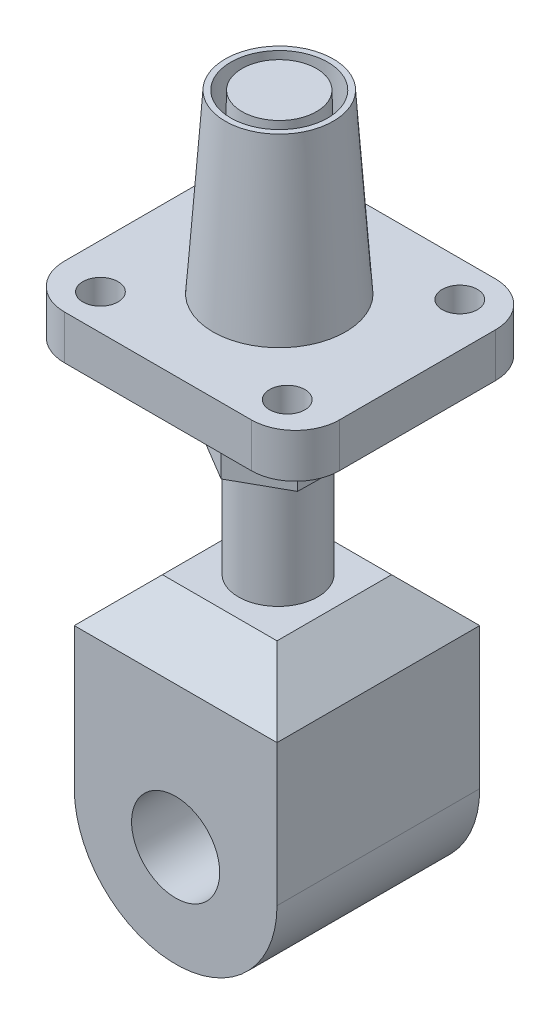
ISO-10303-21;
HEADER;
FILE_DESCRIPTION(('STEP AP214'),'2;1');
FILE_NAME('part.step','',(''),(''),'','','');
FILE_SCHEMA(('AUTOMOTIVE_DESIGN { 1 0 10303 214 1 1 1 1 }'));
ENDSEC;
DATA;
#1=APPLICATION_CONTEXT('core data for automotive mechanical design processes');
#2=APPLICATION_PROTOCOL_DEFINITION('international standard','automotive_design',2000,#1);
#3=PRODUCT_CONTEXT('',#1,'mechanical');
#4=PRODUCT('Part','Part','',(#3));
#5=PRODUCT_RELATED_PRODUCT_CATEGORY('part','',(#4));
#6=PRODUCT_DEFINITION_FORMATION('','',#4);
#7=PRODUCT_DEFINITION_CONTEXT('part definition',#1,'design');
#8=PRODUCT_DEFINITION('design','',#6,#7);
#9=PRODUCT_DEFINITION_SHAPE('','',#8);
#10=(LENGTH_UNIT() NAMED_UNIT(*) SI_UNIT(.MILLI.,.METRE.));
#11=(NAMED_UNIT(*) PLANE_ANGLE_UNIT() SI_UNIT($,.RADIAN.));
#12=(NAMED_UNIT(*) SI_UNIT($,.STERADIAN.) SOLID_ANGLE_UNIT());
#13=UNCERTAINTY_MEASURE_WITH_UNIT(LENGTH_MEASURE(1.E-05),#10,'distance_accuracy_value','');
#14=(GEOMETRIC_REPRESENTATION_CONTEXT(3) GLOBAL_UNCERTAINTY_ASSIGNED_CONTEXT((#13)) GLOBAL_UNIT_ASSIGNED_CONTEXT((#10,
#11,#12)) REPRESENTATION_CONTEXT('',''));
#15=CARTESIAN_POINT('',(0.,0.,0.));
#16=DIRECTION('',(0.,0.,1.));
#17=DIRECTION('',(1.,0.,0.));
#18=AXIS2_PLACEMENT_3D('',#15,#16,#17);
#19=CARTESIAN_POINT('',(0.,87.0242178064716,22.4844557505435));
#20=DIRECTION('',(0.,-1.,0.));
#21=DIRECTION('',(0.,0.,-1.));
#22=AXIS2_PLACEMENT_3D('',#19,#20,#21);
#23=CYLINDRICAL_SURFACE('',#22,9.52563837691278);
#24=CARTESIAN_POINT('',(0.,77.0242178064716,22.4844557505435));
#25=DIRECTION('',(0.,1.,0.));
#26=DIRECTION('',(0.,0.,1.));
#27=AXIS2_PLACEMENT_3D('',#24,#25,#26);
#28=CIRCLE('',#27,9.52563837691278);
#29=CARTESIAN_POINT('',(0.,77.0242178064716,32.0100941274563));
#30=VERTEX_POINT('',#29);
#31=EDGE_CURVE('E342',#30,#30,#28,.T.);
#32=ORIENTED_EDGE('',*,*,#31,.T.);
#33=EDGE_LOOP('',(#32));
#34=FACE_BOUND('',#33,.T.);
#35=CARTESIAN_POINT('',(0.,87.0242178064716,22.4844557505435));
#36=DIRECTION('',(0.,1.,0.));
#37=DIRECTION('',(0.,0.,1.));
#38=AXIS2_PLACEMENT_3D('',#35,#36,#37);
#39=CIRCLE('',#38,9.52563837691278);
#40=CARTESIAN_POINT('',(0.,87.0242178064716,32.0100941274563));
#41=VERTEX_POINT('',#40);
#42=EDGE_CURVE('E260',#41,#41,#39,.T.);
#43=ORIENTED_EDGE('',*,*,#42,.F.);
#44=EDGE_LOOP('',(#43));
#45=FACE_BOUND('',#44,.T.);
#46=ADVANCED_FACE('F41',(#34,#45),#23,.T.);
#47=CARTESIAN_POINT('',(-23.,0.,46.));
#48=DIRECTION('',(-1.,0.,0.));
#49=DIRECTION('',(0.,0.,1.));
#50=AXIS2_PLACEMENT_3D('',#47,#48,#49);
#51=PLANE('',#50);
#52=DIRECTION('',(0.,1.,0.));
#53=VECTOR('',#52,1.);
#54=CARTESIAN_POINT('',(-23.,0.,46.));
#55=LINE('',#54,#53);
#56=CARTESIAN_POINT('',(-23.,0.,46.));
#57=VERTEX_POINT('',#56);
#58=CARTESIAN_POINT('',(-23.,32.0484356129433,46.));
#59=VERTEX_POINT('',#58);
#60=EDGE_CURVE('E217',#57,#59,#55,.T.);
#61=ORIENTED_EDGE('',*,*,#60,.T.);
#62=DIRECTION('',(0.,0.,-1.));
#63=VECTOR('',#62,1.);
#64=CARTESIAN_POINT('',(-23.,32.0484356129433,46.));
#65=LINE('',#64,#63);
#66=CARTESIAN_POINT('',(-23.,32.0484356129433,0.));
#67=VERTEX_POINT('',#66);
#68=EDGE_CURVE('E242',#59,#67,#65,.T.);
#69=ORIENTED_EDGE('',*,*,#68,.T.);
#70=DIRECTION('',(0.,1.,0.));
#71=VECTOR('',#70,1.);
#72=CARTESIAN_POINT('',(-23.,0.,0.));
#73=LINE('',#72,#71);
#74=CARTESIAN_POINT('',(-23.,0.,0.));
#75=VERTEX_POINT('',#74);
#76=EDGE_CURVE('E230',#75,#67,#73,.T.);
#77=ORIENTED_EDGE('',*,*,#76,.F.);
#78=DIRECTION('',(0.,0.,-1.));
#79=VECTOR('',#78,1.);
#80=CARTESIAN_POINT('',(-23.,0.,46.));
#81=LINE('',#80,#79);
#82=EDGE_CURVE('E240',#57,#75,#81,.T.);
#83=ORIENTED_EDGE('',*,*,#82,.F.);
#84=EDGE_LOOP('',(#61,#69,#77,#83));
#85=FACE_BOUND('',#84,.T.);
#86=ADVANCED_FACE('F397',(#85),#51,.T.);
#87=CARTESIAN_POINT('',(0.,0.,46.));
#88=DIRECTION('',(0.,0.,-1.));
#89=DIRECTION('',(-1.,0.,0.));
#90=AXIS2_PLACEMENT_3D('',#87,#88,#89);
#91=CYLINDRICAL_SURFACE('',#90,23.);
#92=CARTESIAN_POINT('',(0.,0.,0.));
#93=DIRECTION('',(0.,0.,1.));
#94=DIRECTION('',(1.,0.,0.));
#95=AXIS2_PLACEMENT_3D('',#92,#93,#94);
#96=CIRCLE('',#95,23.);
#97=CARTESIAN_POINT('',(23.,0.,0.));
#98=VERTEX_POINT('',#97);
#99=EDGE_CURVE('E234',#75,#98,#96,.T.);
#100=ORIENTED_EDGE('',*,*,#99,.T.);
#101=DIRECTION('',(0.,0.,-1.));
#102=VECTOR('',#101,1.);
#103=CARTESIAN_POINT('',(23.,0.,46.));
#104=LINE('',#103,#102);
#105=CARTESIAN_POINT('',(23.,0.,46.));
#106=VERTEX_POINT('',#105);
#107=EDGE_CURVE('E226',#106,#98,#104,.T.);
#108=ORIENTED_EDGE('',*,*,#107,.F.);
#109=CARTESIAN_POINT('',(0.,0.,46.));
#110=DIRECTION('',(0.,0.,1.));
#111=DIRECTION('',(1.,0.,0.));
#112=AXIS2_PLACEMENT_3D('',#109,#110,#111);
#113=CIRCLE('',#112,23.);
#114=EDGE_CURVE('E221',#57,#106,#113,.T.);
#115=ORIENTED_EDGE('',*,*,#114,.F.);
#116=ORIENTED_EDGE('',*,*,#82,.T.);
#117=EDGE_LOOP('',(#100,#108,#115,#116));
#118=FACE_BOUND('',#117,.T.);
#119=ADVANCED_FACE('F403',(#118),#91,.T.);
#120=CARTESIAN_POINT('',(23.,0.,46.));
#121=DIRECTION('',(1.,0.,0.));
#122=DIRECTION('',(0.,0.,-1.));
#123=AXIS2_PLACEMENT_3D('',#120,#121,#122);
#124=PLANE('',#123);
#125=DIRECTION('',(0.,-1.,0.));
#126=VECTOR('',#125,1.);
#127=CARTESIAN_POINT('',(23.,0.,0.));
#128=LINE('',#127,#126);
#129=CARTESIAN_POINT('',(23.,32.0484356129433,0.));
#130=VERTEX_POINT('',#129);
#131=EDGE_CURVE('E218',#130,#98,#128,.T.);
#132=ORIENTED_EDGE('',*,*,#131,.F.);
#133=DIRECTION('',(0.,0.,1.));
#134=VECTOR('',#133,1.);
#135=CARTESIAN_POINT('',(23.,32.0484356129433,46.));
#136=LINE('',#135,#134);
#137=CARTESIAN_POINT('',(23.,32.0484356129433,46.));
#138=VERTEX_POINT('',#137);
#139=EDGE_CURVE('E256',#130,#138,#136,.T.);
#140=ORIENTED_EDGE('',*,*,#139,.T.);
#141=DIRECTION('',(0.,-1.,0.));
#142=VECTOR('',#141,1.);
#143=CARTESIAN_POINT('',(23.,0.,46.));
#144=LINE('',#143,#142);
#145=EDGE_CURVE('E224',#138,#106,#144,.T.);
#146=ORIENTED_EDGE('',*,*,#145,.T.);
#147=ORIENTED_EDGE('',*,*,#107,.T.);
#148=EDGE_LOOP('',(#132,#140,#146,#147));
#149=FACE_BOUND('',#148,.T.);
#150=ADVANCED_FACE('F730',(#149),#124,.T.);
#151=CARTESIAN_POINT('',(0.,0.,46.));
#152=DIRECTION('',(0.,0.,-1.));
#153=DIRECTION('',(-1.,0.,0.));
#154=AXIS2_PLACEMENT_3D('',#151,#152,#153);
#155=CYLINDRICAL_SURFACE('',#154,10.);
#156=CARTESIAN_POINT('',(0.,0.,46.));
#157=DIRECTION('',(0.,0.,1.));
#158=DIRECTION('',(1.,0.,0.));
#159=AXIS2_PLACEMENT_3D('',#156,#157,#158);
#160=CIRCLE('',#159,10.);
#161=CARTESIAN_POINT('',(10.,0.,46.));
#162=VERTEX_POINT('',#161);
#163=EDGE_CURVE('E214',#162,#162,#160,.T.);
#164=ORIENTED_EDGE('',*,*,#163,.T.);
#165=EDGE_LOOP('',(#164));
#166=FACE_BOUND('',#165,.T.);
#167=CARTESIAN_POINT('',(0.,0.,0.));
#168=DIRECTION('',(0.,0.,1.));
#169=DIRECTION('',(1.,0.,0.));
#170=AXIS2_PLACEMENT_3D('',#167,#168,#169);
#171=CIRCLE('',#170,10.);
#172=CARTESIAN_POINT('',(10.,0.,0.));
#173=VERTEX_POINT('',#172);
#174=EDGE_CURVE('E227',#173,#173,#171,.T.);
#175=ORIENTED_EDGE('',*,*,#174,.F.);
#176=EDGE_LOOP('',(#175));
#177=FACE_BOUND('',#176,.T.);
#178=ADVANCED_FACE('F735',(#166,#177),#155,.F.);
#179=CARTESIAN_POINT('',(0.,42.0484356129433,46.));
#180=DIRECTION('',(0.,1.,0.));
#181=DIRECTION('',(0.,0.,1.));
#182=AXIS2_PLACEMENT_3D('',#179,#180,#181);
#183=PLANE('',#182);
#184=CARTESIAN_POINT('',(0.,42.0484356129433,22.7569924059425));
#185=DIRECTION('',(0.,1.,0.));
#186=DIRECTION('',(0.,0.,1.));
#187=AXIS2_PLACEMENT_3D('',#184,#185,#186);
#188=CIRCLE('',#187,9.);
#189=CARTESIAN_POINT('',(0.,42.0484356129433,31.7569924059425));
#190=VERTEX_POINT('',#189);
#191=EDGE_CURVE('E208',#190,#190,#188,.F.);
#192=ORIENTED_EDGE('',*,*,#191,.T.);
#193=EDGE_LOOP('',(#192));
#194=FACE_BOUND('',#193,.T.);
#195=DIRECTION('',(-1.,0.,0.));
#196=VECTOR('',#195,1.);
#197=CARTESIAN_POINT('',(-23.,42.0484356129433,9.99999999999999));
#198=LINE('',#197,#196);
#199=CARTESIAN_POINT('',(13.,42.0484356129433,9.99999999999999));
#200=VERTEX_POINT('',#199);
#201=CARTESIAN_POINT('',(-13.,42.0484356129433,9.99999999999999));
#202=VERTEX_POINT('',#201);
#203=EDGE_CURVE('E249',#200,#202,#198,.T.);
#204=ORIENTED_EDGE('',*,*,#203,.T.);
#205=DIRECTION('',(0.,0.,1.));
#206=VECTOR('',#205,1.);
#207=CARTESIAN_POINT('',(-13.,42.0484356129433,46.));
#208=LINE('',#207,#206);
#209=CARTESIAN_POINT('',(-13.,42.0484356129433,36.));
#210=VERTEX_POINT('',#209);
#211=EDGE_CURVE('E251',#202,#210,#208,.T.);
#212=ORIENTED_EDGE('',*,*,#211,.T.);
#213=DIRECTION('',(1.,0.,0.));
#214=VECTOR('',#213,1.);
#215=CARTESIAN_POINT('',(0.,42.0484356129433,36.));
#216=LINE('',#215,#214);
#217=CARTESIAN_POINT('',(13.,42.0484356129433,36.));
#218=VERTEX_POINT('',#217);
#219=EDGE_CURVE('E245',#210,#218,#216,.T.);
#220=ORIENTED_EDGE('',*,*,#219,.T.);
#221=DIRECTION('',(0.,0.,-1.));
#222=VECTOR('',#221,1.);
#223=CARTESIAN_POINT('',(13.,42.0484356129433,46.));
#224=LINE('',#223,#222);
#225=EDGE_CURVE('E247',#218,#200,#224,.T.);
#226=ORIENTED_EDGE('',*,*,#225,.T.);
#227=EDGE_LOOP('',(#204,#212,#220,#226));
#228=FACE_BOUND('',#227,.T.);
#229=ADVANCED_FACE('F722',(#194,#228),#183,.T.);
#230=CARTESIAN_POINT('',(0.,0.,46.));
#231=DIRECTION('',(0.,0.,1.));
#232=DIRECTION('',(1.,0.,0.));
#233=AXIS2_PLACEMENT_3D('',#230,#231,#232);
#234=PLANE('',#233);
#235=ORIENTED_EDGE('',*,*,#163,.F.);
#236=EDGE_LOOP('',(#235));
#237=FACE_BOUND('',#236,.T.);
#238=ORIENTED_EDGE('',*,*,#145,.F.);
#239=DIRECTION('',(-1.,0.,0.));
#240=VECTOR('',#239,1.);
#241=CARTESIAN_POINT('',(0.,32.0484356129433,46.));
#242=LINE('',#241,#240);
#243=EDGE_CURVE('E258',#138,#59,#242,.T.);
#244=ORIENTED_EDGE('',*,*,#243,.T.);
#245=ORIENTED_EDGE('',*,*,#60,.F.);
#246=ORIENTED_EDGE('',*,*,#114,.T.);
#247=EDGE_LOOP('',(#238,#244,#245,#246));
#248=FACE_BOUND('',#247,.T.);
#249=ADVANCED_FACE('F710',(#237,#248),#234,.T.);
#250=CARTESIAN_POINT('',(0.,0.,0.));
#251=DIRECTION('',(0.,0.,1.));
#252=DIRECTION('',(1.,0.,0.));
#253=AXIS2_PLACEMENT_3D('',#250,#251,#252);
#254=PLANE('',#253);
#255=ORIENTED_EDGE('',*,*,#174,.T.);
#256=EDGE_LOOP('',(#255));
#257=FACE_BOUND('',#256,.T.);
#258=ORIENTED_EDGE('',*,*,#76,.T.);
#259=DIRECTION('',(1.,0.,0.));
#260=VECTOR('',#259,1.);
#261=CARTESIAN_POINT('',(23.,32.0484356129433,0.));
#262=LINE('',#261,#260);
#263=EDGE_CURVE('E254',#67,#130,#262,.T.);
#264=ORIENTED_EDGE('',*,*,#263,.T.);
#265=ORIENTED_EDGE('',*,*,#131,.T.);
#266=ORIENTED_EDGE('',*,*,#99,.F.);
#267=EDGE_LOOP('',(#258,#264,#265,#266));
#268=FACE_BOUND('',#267,.T.);
#269=ADVANCED_FACE('F701',(#257,#268),#254,.F.);
#270=CARTESIAN_POINT('',(13.,42.0484356129433,46.));
#271=DIRECTION('',(-0.707106781186548,-0.707106781186546,0.));
#272=DIRECTION('',(0.,0.,-1.));
#273=AXIS2_PLACEMENT_3D('',#270,#271,#272);
#274=PLANE('',#273);
#275=DIRECTION('',(0.577350269189625,-0.577350269189627,-0.577350269189625));
#276=VECTOR('',#275,1.);
#277=CARTESIAN_POINT('',(1.00000000000003,54.0484356129433,22.));
#278=LINE('',#277,#276);
#279=EDGE_CURVE('E265',#200,#130,#278,.T.);
#280=ORIENTED_EDGE('',*,*,#279,.F.);
#281=ORIENTED_EDGE('',*,*,#225,.F.);
#282=DIRECTION('',(-0.577350269189625,0.577350269189627,-0.577350269189625));
#283=VECTOR('',#282,1.);
#284=CARTESIAN_POINT('',(8.66666666666668,46.3817689462766,31.6666666666667));
#285=LINE('',#284,#283);
#286=EDGE_CURVE('E231',#138,#218,#285,.T.);
#287=ORIENTED_EDGE('',*,*,#286,.F.);
#288=ORIENTED_EDGE('',*,*,#139,.F.);
#289=EDGE_LOOP('',(#280,#281,#287,#288));
#290=FACE_BOUND('',#289,.T.);
#291=ADVANCED_FACE('F692',(#290),#274,.F.);
#292=CARTESIAN_POINT('',(0.,42.0484356129433,36.));
#293=DIRECTION('',(0.,-0.707106781186546,-0.707106781186548));
#294=DIRECTION('',(1.,0.,0.));
#295=AXIS2_PLACEMENT_3D('',#292,#293,#294);
#296=PLANE('',#295);
#297=ORIENTED_EDGE('',*,*,#286,.T.);
#298=ORIENTED_EDGE('',*,*,#219,.F.);
#299=DIRECTION('',(-0.577350269189625,-0.577350269189627,0.577350269189625));
#300=VECTOR('',#299,1.);
#301=CARTESIAN_POINT('',(-8.66666666666668,46.3817689462766,31.6666666666667));
#302=LINE('',#301,#300);
#303=EDGE_CURVE('E263',#59,#210,#302,.F.);
#304=ORIENTED_EDGE('',*,*,#303,.F.);
#305=ORIENTED_EDGE('',*,*,#243,.F.);
#306=EDGE_LOOP('',(#297,#298,#304,#305));
#307=FACE_BOUND('',#306,.T.);
#308=ADVANCED_FACE('F683',(#307),#296,.F.);
#309=CARTESIAN_POINT('',(0.,32.0484356129433,0.));
#310=DIRECTION('',(0.,0.707106781186546,-0.707106781186548));
#311=DIRECTION('',(-1.,0.,0.));
#312=AXIS2_PLACEMENT_3D('',#309,#310,#311);
#313=PLANE('',#312);
#314=ORIENTED_EDGE('',*,*,#279,.T.);
#315=ORIENTED_EDGE('',*,*,#263,.F.);
#316=DIRECTION('',(-0.577350269189625,-0.577350269189627,-0.577350269189625));
#317=VECTOR('',#316,1.);
#318=CARTESIAN_POINT('',(-15.3333333333333,39.7151022796099,7.66666666666665));
#319=LINE('',#318,#317);
#320=EDGE_CURVE('E261',#202,#67,#319,.T.);
#321=ORIENTED_EDGE('',*,*,#320,.F.);
#322=ORIENTED_EDGE('',*,*,#203,.F.);
#323=EDGE_LOOP('',(#314,#315,#321,#322));
#324=FACE_BOUND('',#323,.T.);
#325=ADVANCED_FACE('F674',(#324),#313,.T.);
#326=CARTESIAN_POINT('',(-23.,32.0484356129433,46.));
#327=DIRECTION('',(0.707106781186548,-0.707106781186546,0.));
#328=DIRECTION('',(0.,0.,-1.));
#329=AXIS2_PLACEMENT_3D('',#326,#327,#328);
#330=PLANE('',#329);
#331=ORIENTED_EDGE('',*,*,#303,.T.);
#332=ORIENTED_EDGE('',*,*,#211,.F.);
#333=ORIENTED_EDGE('',*,*,#320,.T.);
#334=ORIENTED_EDGE('',*,*,#68,.F.);
#335=EDGE_LOOP('',(#331,#332,#333,#334));
#336=FACE_BOUND('',#335,.T.);
#337=ADVANCED_FACE('F664',(#336),#330,.F.);
#338=CARTESIAN_POINT('',(0.,67.0242178064716,22.7569924059425));
#339=DIRECTION('',(0.,-1.,0.));
#340=DIRECTION('',(0.,0.,-1.));
#341=AXIS2_PLACEMENT_3D('',#338,#339,#340);
#342=CYLINDRICAL_SURFACE('',#341,9.);
#343=ORIENTED_EDGE('',*,*,#191,.F.);
#344=EDGE_LOOP('',(#343));
#345=FACE_BOUND('',#344,.T.);
#346=CARTESIAN_POINT('',(0.,67.0242178064716,22.7569924059425));
#347=DIRECTION('',(0.,1.,0.));
#348=DIRECTION('',(0.,0.,1.));
#349=AXIS2_PLACEMENT_3D('',#346,#347,#348);
#350=CIRCLE('',#349,9.);
#351=CARTESIAN_POINT('',(0.,67.0242178064716,31.7569924059425));
#352=VERTEX_POINT('',#351);
#353=EDGE_CURVE('E205',#352,#352,#350,.T.);
#354=ORIENTED_EDGE('',*,*,#353,.F.);
#355=EDGE_LOOP('',(#354));
#356=FACE_BOUND('',#355,.T.);
#357=ADVANCED_FACE('F656',(#345,#356),#342,.T.);
#358=CARTESIAN_POINT('',(-0.179771257897109,77.0242178064716,35.4975389919702));
#359=DIRECTION('',(-0.487731685204601,0.,-0.872993587174316));
#360=DIRECTION('',(-0.872993587174316,0.,0.487731685204601));
#361=AXIS2_PLACEMENT_3D('',#358,#359,#360);
#362=PLANE('',#361);
#363=DIRECTION('',(0.872993587174316,0.,-0.487731685204601));
#364=VECTOR('',#363,1.);
#365=CARTESIAN_POINT('',(-0.179771257897109,67.0242178064716,35.4975389919702));
#366=LINE('',#365,#364);
#367=CARTESIAN_POINT('',(-0.179771257897109,67.0242178064716,35.4975389919702));
#368=VERTEX_POINT('',#367);
#369=CARTESIAN_POINT('',(10.9437513726505,67.0242178064716,29.2829521751655));
#370=VERTEX_POINT('',#369);
#371=EDGE_CURVE('E204',#368,#370,#366,.T.);
#372=ORIENTED_EDGE('',*,*,#371,.T.);
#373=DIRECTION('',(0.,-1.,0.));
#374=VECTOR('',#373,1.);
#375=CARTESIAN_POINT('',(10.9437513726505,77.0242178064716,29.2829521751655));
#376=LINE('',#375,#374);
#377=CARTESIAN_POINT('',(10.9437513726505,77.0242178064716,29.2829521751655));
#378=VERTEX_POINT('',#377);
#379=EDGE_CURVE('E184',#378,#370,#376,.T.);
#380=ORIENTED_EDGE('',*,*,#379,.F.);
#381=DIRECTION('',(0.872993587174316,0.,-0.487731685204601));
#382=VECTOR('',#381,1.);
#383=CARTESIAN_POINT('',(-0.179771257897109,77.0242178064716,35.4975389919702));
#384=LINE('',#383,#382);
#385=CARTESIAN_POINT('',(-0.179771257897109,77.0242178064716,35.4975389919702));
#386=VERTEX_POINT('',#385);
#387=EDGE_CURVE('E191',#386,#378,#384,.T.);
#388=ORIENTED_EDGE('',*,*,#387,.F.);
#389=DIRECTION('',(0.,-1.,0.));
#390=VECTOR('',#389,1.);
#391=CARTESIAN_POINT('',(-0.179771257897109,77.0242178064716,35.4975389919702));
#392=LINE('',#391,#390);
#393=EDGE_CURVE('E351',#386,#368,#392,.T.);
#394=ORIENTED_EDGE('',*,*,#393,.T.);
#395=EDGE_LOOP('',(#372,#380,#388,#394));
#396=FACE_BOUND('',#395,.T.);
#397=ADVANCED_FACE('F202',(#396),#362,.F.);
#398=CARTESIAN_POINT('',(10.9437513726505,77.0242178064716,29.2829521751655));
#399=DIRECTION('',(-0.999900466436163,0.,-0.0141087639693788));
#400=DIRECTION('',(-0.0141087639693788,0.,0.999900466436163));
#401=AXIS2_PLACEMENT_3D('',#398,#399,#400);
#402=PLANE('',#401);
#403=DIRECTION('',(0.0141087639693788,0.,-0.999900466436163));
#404=VECTOR('',#403,1.);
#405=CARTESIAN_POINT('',(10.9437513726505,67.0242178064716,29.2829521751655));
#406=LINE('',#405,#404);
#407=CARTESIAN_POINT('',(11.1235226305476,67.0242178064716,16.5424055891379));
#408=VERTEX_POINT('',#407);
#409=EDGE_CURVE('E353',#370,#408,#406,.T.);
#410=ORIENTED_EDGE('',*,*,#409,.T.);
#411=DIRECTION('',(0.,-1.,0.));
#412=VECTOR('',#411,1.);
#413=CARTESIAN_POINT('',(11.1235226305476,77.0242178064716,16.5424055891379));
#414=LINE('',#413,#412);
#415=CARTESIAN_POINT('',(11.1235226305476,77.0242178064716,16.5424055891379));
#416=VERTEX_POINT('',#415);
#417=EDGE_CURVE('E187',#416,#408,#414,.T.);
#418=ORIENTED_EDGE('',*,*,#417,.F.);
#419=DIRECTION('',(0.0141087639693788,0.,-0.999900466436163));
#420=VECTOR('',#419,1.);
#421=CARTESIAN_POINT('',(10.9437513726505,77.0242178064716,29.2829521751655));
#422=LINE('',#421,#420);
#423=EDGE_CURVE('E180',#378,#416,#422,.T.);
#424=ORIENTED_EDGE('',*,*,#423,.F.);
#425=ORIENTED_EDGE('',*,*,#379,.T.);
#426=EDGE_LOOP('',(#410,#418,#424,#425));
#427=FACE_BOUND('',#426,.T.);
#428=ADVANCED_FACE('F182',(#427),#402,.F.);
#429=CARTESIAN_POINT('',(11.1235226305476,77.0242178064716,16.5424055891379));
#430=DIRECTION('',(-0.512168781231562,0.,0.858884823204937));
#431=DIRECTION('',(0.858884823204937,0.,0.512168781231562));
#432=AXIS2_PLACEMENT_3D('',#429,#430,#431);
#433=PLANE('',#432);
#434=DIRECTION('',(-0.858884823204937,0.,-0.512168781231562));
#435=VECTOR('',#434,1.);
#436=CARTESIAN_POINT('',(11.1235226305476,67.0242178064716,16.5424055891379));
#437=LINE('',#436,#435);
#438=CARTESIAN_POINT('',(0.179771257897117,67.0242178064716,10.0164458199148));
#439=VERTEX_POINT('',#438);
#440=EDGE_CURVE('E355',#408,#439,#437,.T.);
#441=ORIENTED_EDGE('',*,*,#440,.T.);
#442=DIRECTION('',(0.,-1.,0.));
#443=VECTOR('',#442,1.);
#444=CARTESIAN_POINT('',(0.179771257897117,77.0242178064716,10.0164458199148));
#445=LINE('',#444,#443);
#446=CARTESIAN_POINT('',(0.179771257897117,77.0242178064716,10.0164458199148));
#447=VERTEX_POINT('',#446);
#448=EDGE_CURVE('E210',#447,#439,#445,.T.);
#449=ORIENTED_EDGE('',*,*,#448,.F.);
#450=DIRECTION('',(-0.858884823204937,0.,-0.512168781231562));
#451=VECTOR('',#450,1.);
#452=CARTESIAN_POINT('',(11.1235226305476,77.0242178064716,16.5424055891379));
#453=LINE('',#452,#451);
#454=EDGE_CURVE('E190',#416,#447,#453,.T.);
#455=ORIENTED_EDGE('',*,*,#454,.F.);
#456=ORIENTED_EDGE('',*,*,#417,.T.);
#457=EDGE_LOOP('',(#441,#449,#455,#456));
#458=FACE_BOUND('',#457,.T.);
#459=ADVANCED_FACE('F387',(#458),#433,.F.);
#460=CARTESIAN_POINT('',(0.179771257897117,77.0242178064716,10.0164458199148));
#461=DIRECTION('',(0.487731685204601,0.,0.872993587174316));
#462=DIRECTION('',(0.872993587174316,0.,-0.487731685204601));
#463=AXIS2_PLACEMENT_3D('',#460,#461,#462);
#464=PLANE('',#463);
#465=DIRECTION('',(-0.872993587174316,0.,0.4877316852046));
#466=VECTOR('',#465,1.);
#467=CARTESIAN_POINT('',(0.179771257897117,67.0242178064716,10.0164458199148));
#468=LINE('',#467,#466);
#469=CARTESIAN_POINT('',(-10.9437513726505,67.0242178064716,16.2310326367195));
#470=VERTEX_POINT('',#469);
#471=EDGE_CURVE('E357',#439,#470,#468,.T.);
#472=ORIENTED_EDGE('',*,*,#471,.T.);
#473=DIRECTION('',(0.,-1.,0.));
#474=VECTOR('',#473,1.);
#475=CARTESIAN_POINT('',(-10.9437513726505,77.0242178064716,16.2310326367195));
#476=LINE('',#475,#474);
#477=CARTESIAN_POINT('',(-10.9437513726505,77.0242178064716,16.2310326367195));
#478=VERTEX_POINT('',#477);
#479=EDGE_CURVE('E366',#478,#470,#476,.T.);
#480=ORIENTED_EDGE('',*,*,#479,.F.);
#481=DIRECTION('',(-0.872993587174316,0.,0.4877316852046));
#482=VECTOR('',#481,1.);
#483=CARTESIAN_POINT('',(0.179771257897117,77.0242178064716,10.0164458199148));
#484=LINE('',#483,#482);
#485=EDGE_CURVE('E346',#447,#478,#484,.T.);
#486=ORIENTED_EDGE('',*,*,#485,.F.);
#487=ORIENTED_EDGE('',*,*,#448,.T.);
#488=EDGE_LOOP('',(#472,#480,#486,#487));
#489=FACE_BOUND('',#488,.T.);
#490=ADVANCED_FACE('F373',(#489),#464,.F.);
#491=CARTESIAN_POINT('',(-10.9437513726505,77.0242178064716,16.2310326367195));
#492=DIRECTION('',(0.999900466436163,0.,0.014108763969379));
#493=DIRECTION('',(0.014108763969379,0.,-0.999900466436163));
#494=AXIS2_PLACEMENT_3D('',#491,#492,#493);
#495=PLANE('',#494);
#496=DIRECTION('',(-0.014108763969379,0.,0.999900466436163));
#497=VECTOR('',#496,1.);
#498=CARTESIAN_POINT('',(-10.9437513726505,67.0242178064716,16.2310326367195));
#499=LINE('',#498,#497);
#500=CARTESIAN_POINT('',(-11.1235226305476,67.0242178064716,28.9715792227472));
#501=VERTEX_POINT('',#500);
#502=EDGE_CURVE('E359',#470,#501,#499,.T.);
#503=ORIENTED_EDGE('',*,*,#502,.T.);
#504=DIRECTION('',(0.,-1.,0.));
#505=VECTOR('',#504,1.);
#506=CARTESIAN_POINT('',(-11.1235226305476,77.0242178064716,28.9715792227472));
#507=LINE('',#506,#505);
#508=CARTESIAN_POINT('',(-11.1235226305476,77.0242178064716,28.9715792227472));
#509=VERTEX_POINT('',#508);
#510=EDGE_CURVE('E363',#509,#501,#507,.T.);
#511=ORIENTED_EDGE('',*,*,#510,.F.);
#512=DIRECTION('',(-0.014108763969379,0.,0.999900466436163));
#513=VECTOR('',#512,1.);
#514=CARTESIAN_POINT('',(-10.9437513726505,77.0242178064716,16.2310326367195));
#515=LINE('',#514,#513);
#516=EDGE_CURVE('E348',#478,#509,#515,.T.);
#517=ORIENTED_EDGE('',*,*,#516,.F.);
#518=ORIENTED_EDGE('',*,*,#479,.T.);
#519=EDGE_LOOP('',(#503,#511,#517,#518));
#520=FACE_BOUND('',#519,.T.);
#521=ADVANCED_FACE('F383',(#520),#495,.F.);
#522=CARTESIAN_POINT('',(-11.1235226305476,77.0242178064716,28.9715792227472));
#523=DIRECTION('',(0.512168781231562,0.,-0.858884823204937));
#524=DIRECTION('',(-0.858884823204937,0.,-0.512168781231562));
#525=AXIS2_PLACEMENT_3D('',#522,#523,#524);
#526=PLANE('',#525);
#527=DIRECTION('',(0.858884823204937,0.,0.512168781231562));
#528=VECTOR('',#527,1.);
#529=CARTESIAN_POINT('',(-11.1235226305476,67.0242178064716,28.9715792227472));
#530=LINE('',#529,#528);
#531=EDGE_CURVE('E200',#501,#368,#530,.T.);
#532=ORIENTED_EDGE('',*,*,#531,.T.);
#533=ORIENTED_EDGE('',*,*,#393,.F.);
#534=DIRECTION('',(0.858884823204937,0.,0.512168781231562));
#535=VECTOR('',#534,1.);
#536=CARTESIAN_POINT('',(-11.1235226305476,77.0242178064716,28.9715792227472));
#537=LINE('',#536,#535);
#538=EDGE_CURVE('E196',#509,#386,#537,.T.);
#539=ORIENTED_EDGE('',*,*,#538,.F.);
#540=ORIENTED_EDGE('',*,*,#510,.T.);
#541=EDGE_LOOP('',(#532,#533,#539,#540));
#542=FACE_BOUND('',#541,.T.);
#543=ADVANCED_FACE('F386',(#542),#526,.F.);
#544=CARTESIAN_POINT('',(0.,77.0242178064716,0.));
#545=DIRECTION('',(0.,1.,0.));
#546=DIRECTION('',(0.,0.,1.));
#547=AXIS2_PLACEMENT_3D('',#544,#545,#546);
#548=PLANE('',#547);
#549=ORIENTED_EDGE('',*,*,#31,.F.);
#550=EDGE_LOOP('',(#549));
#551=FACE_BOUND('',#550,.T.);
#552=ORIENTED_EDGE('',*,*,#387,.T.);
#553=ORIENTED_EDGE('',*,*,#423,.T.);
#554=ORIENTED_EDGE('',*,*,#454,.T.);
#555=ORIENTED_EDGE('',*,*,#485,.T.);
#556=ORIENTED_EDGE('',*,*,#516,.T.);
#557=ORIENTED_EDGE('',*,*,#538,.T.);
#558=EDGE_LOOP('',(#552,#553,#554,#555,#556,#557));
#559=FACE_BOUND('',#558,.T.);
#560=ADVANCED_FACE('F194',(#551,#559),#548,.T.);
#561=CARTESIAN_POINT('',(0.,67.0242178064716,0.));
#562=DIRECTION('',(0.,1.,0.));
#563=DIRECTION('',(0.,0.,1.));
#564=AXIS2_PLACEMENT_3D('',#561,#562,#563);
#565=PLANE('',#564);
#566=ORIENTED_EDGE('',*,*,#353,.T.);
#567=EDGE_LOOP('',(#566));
#568=FACE_BOUND('',#567,.T.);
#569=ORIENTED_EDGE('',*,*,#371,.F.);
#570=ORIENTED_EDGE('',*,*,#531,.F.);
#571=ORIENTED_EDGE('',*,*,#502,.F.);
#572=ORIENTED_EDGE('',*,*,#471,.F.);
#573=ORIENTED_EDGE('',*,*,#440,.F.);
#574=ORIENTED_EDGE('',*,*,#409,.F.);
#575=EDGE_LOOP('',(#569,#570,#571,#572,#573,#574));
#576=FACE_BOUND('',#575,.T.);
#577=ADVANCED_FACE('F379',(#568,#576),#565,.F.);
#578=CARTESIAN_POINT('',(-30.7647614076674,87.0242178064716,-4.94587331660175));
#579=DIRECTION('',(1.,0.,0.));
#580=DIRECTION('',(0.,0.,-1.));
#581=AXIS2_PLACEMENT_3D('',#578,#579,#580);
#582=PLANE('',#581);
#583=DIRECTION('',(0.,0.,-1.));
#584=VECTOR('',#583,1.);
#585=CARTESIAN_POINT('',(-30.7647614076674,97.0242178064716,-4.94587331660175));
#586=LINE('',#585,#584);
#587=CARTESIAN_POINT('',(-30.7647614076674,97.0242178064716,40.4598581284864));
#588=VERTEX_POINT('',#587);
#589=CARTESIAN_POINT('',(-30.7647614076674,97.0242178064716,5.05412668339825));
#590=VERTEX_POINT('',#589);
#591=EDGE_CURVE('E329',#588,#590,#586,.T.);
#592=ORIENTED_EDGE('',*,*,#591,.T.);
#593=DIRECTION('',(0.,1.,0.));
#594=VECTOR('',#593,1.);
#595=CARTESIAN_POINT('',(-30.7647614076674,87.0242178064716,5.05412668339825));
#596=LINE('',#595,#594);
#597=CARTESIAN_POINT('',(-30.7647614076674,87.0242178064716,5.05412668339825));
#598=VERTEX_POINT('',#597);
#599=EDGE_CURVE('E50',#590,#598,#596,.F.);
#600=ORIENTED_EDGE('',*,*,#599,.T.);
#601=DIRECTION('',(0.,0.,-1.));
#602=VECTOR('',#601,1.);
#603=CARTESIAN_POINT('',(-30.7647614076674,87.0242178064716,-4.94587331660175));
#604=LINE('',#603,#602);
#605=CARTESIAN_POINT('',(-30.7647614076674,87.0242178064716,40.4598581284864));
#606=VERTEX_POINT('',#605);
#607=EDGE_CURVE('E339',#606,#598,#604,.T.);
#608=ORIENTED_EDGE('',*,*,#607,.F.);
#609=DIRECTION('',(0.,1.,0.));
#610=VECTOR('',#609,1.);
#611=CARTESIAN_POINT('',(-30.7647614076674,87.0242178064716,40.4598581284864));
#612=LINE('',#611,#610);
#613=EDGE_CURVE('E280',#606,#588,#612,.T.);
#614=ORIENTED_EDGE('',*,*,#613,.T.);
#615=EDGE_LOOP('',(#592,#600,#608,#614));
#616=FACE_BOUND('',#615,.T.);
#617=ADVANCED_FACE('F416',(#616),#582,.F.);
#618=CARTESIAN_POINT('',(-30.7647614076674,87.0242178064716,-4.94587331660175));
#619=DIRECTION('',(0.,0.,1.));
#620=DIRECTION('',(1.,0.,0.));
#621=AXIS2_PLACEMENT_3D('',#618,#619,#620);
#622=PLANE('',#621);
#623=DIRECTION('',(1.,0.,0.));
#624=VECTOR('',#623,1.);
#625=CARTESIAN_POINT('',(-30.7647614076674,87.0242178064716,-4.94587331660175));
#626=LINE('',#625,#624);
#627=CARTESIAN_POINT('',(-20.7647614076674,87.0242178064716,-4.94587331660175));
#628=VERTEX_POINT('',#627);
#629=CARTESIAN_POINT('',(21.639588746274,87.0242178064716,-4.94587331660175));
#630=VERTEX_POINT('',#629);
#631=EDGE_CURVE('E843',#628,#630,#626,.T.);
#632=ORIENTED_EDGE('',*,*,#631,.F.);
#633=DIRECTION('',(0.,1.,0.));
#634=VECTOR('',#633,1.);
#635=CARTESIAN_POINT('',(-20.7647614076674,87.0242178064716,-4.94587331660175));
#636=LINE('',#635,#634);
#637=CARTESIAN_POINT('',(-20.7647614076674,97.0242178064716,-4.94587331660175));
#638=VERTEX_POINT('',#637);
#639=EDGE_CURVE('E309',#628,#638,#636,.T.);
#640=ORIENTED_EDGE('',*,*,#639,.T.);
#641=DIRECTION('',(1.,0.,0.));
#642=VECTOR('',#641,1.);
#643=CARTESIAN_POINT('',(-30.7647614076674,97.0242178064716,-4.94587331660175));
#644=LINE('',#643,#642);
#645=CARTESIAN_POINT('',(21.639588746274,97.0242178064716,-4.94587331660175));
#646=VERTEX_POINT('',#645);
#647=EDGE_CURVE('E324',#638,#646,#644,.T.);
#648=ORIENTED_EDGE('',*,*,#647,.T.);
#649=DIRECTION('',(0.,1.,0.));
#650=VECTOR('',#649,1.);
#651=CARTESIAN_POINT('',(21.639588746274,87.0242178064716,-4.94587331660175));
#652=LINE('',#651,#650);
#653=EDGE_CURVE('E306',#646,#630,#652,.F.);
#654=ORIENTED_EDGE('',*,*,#653,.T.);
#655=EDGE_LOOP('',(#632,#640,#648,#654));
#656=FACE_BOUND('',#655,.T.);
#657=ADVANCED_FACE('F444',(#656),#622,.F.);
#658=CARTESIAN_POINT('',(31.639588746274,87.0242178064716,-4.94587331660175));
#659=DIRECTION('',(-1.,0.,0.));
#660=DIRECTION('',(0.,0.,1.));
#661=AXIS2_PLACEMENT_3D('',#658,#659,#660);
#662=PLANE('',#661);
#663=DIRECTION('',(0.,0.,1.));
#664=VECTOR('',#663,1.);
#665=CARTESIAN_POINT('',(31.639588746274,87.0242178064716,-4.94587331660175));
#666=LINE('',#665,#664);
#667=CARTESIAN_POINT('',(31.639588746274,87.0242178064716,5.05412668339825));
#668=VERTEX_POINT('',#667);
#669=CARTESIAN_POINT('',(31.639588746274,87.0242178064716,40.4598581284864));
#670=VERTEX_POINT('',#669);
#671=EDGE_CURVE('E845',#668,#670,#666,.T.);
#672=ORIENTED_EDGE('',*,*,#671,.F.);
#673=DIRECTION('',(0.,1.,0.));
#674=VECTOR('',#673,1.);
#675=CARTESIAN_POINT('',(31.639588746274,87.0242178064716,5.05412668339825));
#676=LINE('',#675,#674);
#677=CARTESIAN_POINT('',(31.639588746274,97.0242178064716,5.05412668339825));
#678=VERTEX_POINT('',#677);
#679=EDGE_CURVE('E303',#668,#678,#676,.T.);
#680=ORIENTED_EDGE('',*,*,#679,.T.);
#681=DIRECTION('',(0.,0.,1.));
#682=VECTOR('',#681,1.);
#683=CARTESIAN_POINT('',(31.639588746274,97.0242178064716,-4.94587331660175));
#684=LINE('',#683,#682);
#685=CARTESIAN_POINT('',(31.639588746274,97.0242178064716,40.4598581284864));
#686=VERTEX_POINT('',#685);
#687=EDGE_CURVE('E328',#678,#686,#684,.T.);
#688=ORIENTED_EDGE('',*,*,#687,.T.);
#689=DIRECTION('',(0.,1.,0.));
#690=VECTOR('',#689,1.);
#691=CARTESIAN_POINT('',(31.639588746274,87.0242178064716,40.4598581284864));
#692=LINE('',#691,#690);
#693=EDGE_CURVE('E301',#686,#670,#692,.F.);
#694=ORIENTED_EDGE('',*,*,#693,.T.);
#695=EDGE_LOOP('',(#672,#680,#688,#694));
#696=FACE_BOUND('',#695,.T.);
#697=ADVANCED_FACE('F451',(#696),#662,.F.);
#698=CARTESIAN_POINT('',(-30.7647614076674,87.0242178064716,50.4598581284864));
#699=DIRECTION('',(0.,0.,-1.));
#700=DIRECTION('',(-1.,0.,0.));
#701=AXIS2_PLACEMENT_3D('',#698,#699,#700);
#702=PLANE('',#701);
#703=DIRECTION('',(-1.,0.,0.));
#704=VECTOR('',#703,1.);
#705=CARTESIAN_POINT('',(-30.7647614076674,97.0242178064716,50.4598581284864));
#706=LINE('',#705,#704);
#707=CARTESIAN_POINT('',(21.639588746274,97.0242178064716,50.4598581284864));
#708=VERTEX_POINT('',#707);
#709=CARTESIAN_POINT('',(-20.7647614076674,97.0242178064716,50.4598581284864));
#710=VERTEX_POINT('',#709);
#711=EDGE_CURVE('E332',#708,#710,#706,.T.);
#712=ORIENTED_EDGE('',*,*,#711,.T.);
#713=DIRECTION('',(0.,1.,0.));
#714=VECTOR('',#713,1.);
#715=CARTESIAN_POINT('',(-20.7647614076674,87.0242178064716,50.4598581284864));
#716=LINE('',#715,#714);
#717=CARTESIAN_POINT('',(-20.7647614076674,87.0242178064716,50.4598581284864));
#718=VERTEX_POINT('',#717);
#719=EDGE_CURVE('E293',#710,#718,#716,.F.);
#720=ORIENTED_EDGE('',*,*,#719,.T.);
#721=DIRECTION('',(-1.,0.,0.));
#722=VECTOR('',#721,1.);
#723=CARTESIAN_POINT('',(-30.7647614076674,87.0242178064716,50.4598581284864));
#724=LINE('',#723,#722);
#725=CARTESIAN_POINT('',(21.639588746274,87.0242178064716,50.4598581284864));
#726=VERTEX_POINT('',#725);
#727=EDGE_CURVE('E276',#726,#718,#724,.T.);
#728=ORIENTED_EDGE('',*,*,#727,.F.);
#729=DIRECTION('',(0.,1.,0.));
#730=VECTOR('',#729,1.);
#731=CARTESIAN_POINT('',(21.639588746274,87.0242178064716,50.4598581284864));
#732=LINE('',#731,#730);
#733=EDGE_CURVE('E290',#726,#708,#732,.T.);
#734=ORIENTED_EDGE('',*,*,#733,.T.);
#735=EDGE_LOOP('',(#712,#720,#728,#734));
#736=FACE_BOUND('',#735,.T.);
#737=ADVANCED_FACE('F459',(#736),#702,.F.);
#738=CARTESIAN_POINT('',(0.,87.0242178064716,0.));
#739=DIRECTION('',(0.,1.,0.));
#740=DIRECTION('',(0.,0.,1.));
#741=AXIS2_PLACEMENT_3D('',#738,#739,#740);
#742=PLANE('',#741);
#743=CARTESIAN_POINT('',(21.7448247060901,87.0242178064716,42.4161406800678));
#744=DIRECTION('',(0.,1.,0.));
#745=DIRECTION('',(0.,0.,1.));
#746=AXIS2_PLACEMENT_3D('',#743,#744,#745);
#747=CIRCLE('',#746,4.);
#748=CARTESIAN_POINT('',(21.7448247060901,87.0242178064716,46.4161406800678));
#749=VERTEX_POINT('',#748);
#750=EDGE_CURVE('E811',#749,#749,#747,.T.);
#751=ORIENTED_EDGE('',*,*,#750,.T.);
#752=EDGE_LOOP('',(#751));
#753=FACE_BOUND('',#752,.T.);
#754=CARTESIAN_POINT('',(-20.6522824184958,87.0242178064716,3.15921832618571));
#755=DIRECTION('',(0.,1.,0.));
#756=DIRECTION('',(0.,0.,1.));
#757=AXIS2_PLACEMENT_3D('',#754,#755,#756);
#758=CIRCLE('',#757,4.);
#759=CARTESIAN_POINT('',(-20.6522824184958,87.0242178064716,7.15921832618571));
#760=VERTEX_POINT('',#759);
#761=EDGE_CURVE('E815',#760,#760,#758,.T.);
#762=ORIENTED_EDGE('',*,*,#761,.T.);
#763=EDGE_LOOP('',(#762));
#764=FACE_BOUND('',#763,.T.);
#765=CARTESIAN_POINT('',(21.639588746274,87.0242178064716,3.15921832618571));
#766=DIRECTION('',(0.,1.,0.));
#767=DIRECTION('',(0.,0.,1.));
#768=AXIS2_PLACEMENT_3D('',#765,#766,#767);
#769=CIRCLE('',#768,4.);
#770=CARTESIAN_POINT('',(21.639588746274,87.0242178064716,7.15921832618571));
#771=VERTEX_POINT('',#770);
#772=EDGE_CURVE('E825',#771,#771,#769,.T.);
#773=ORIENTED_EDGE('',*,*,#772,.T.);
#774=EDGE_LOOP('',(#773));
#775=FACE_BOUND('',#774,.T.);
#776=CARTESIAN_POINT('',(-20.6522824184958,87.0242178064716,42.4161406800678));
#777=DIRECTION('',(0.,1.,0.));
#778=DIRECTION('',(0.,0.,1.));
#779=AXIS2_PLACEMENT_3D('',#776,#777,#778);
#780=CIRCLE('',#779,4.);
#781=CARTESIAN_POINT('',(-20.6522824184958,87.0242178064716,46.4161406800678));
#782=VERTEX_POINT('',#781);
#783=EDGE_CURVE('E831',#782,#782,#780,.T.);
#784=ORIENTED_EDGE('',*,*,#783,.T.);
#785=EDGE_LOOP('',(#784));
#786=FACE_BOUND('',#785,.T.);
#787=ORIENTED_EDGE('',*,*,#42,.T.);
#788=EDGE_LOOP('',(#787));
#789=FACE_BOUND('',#788,.T.);
#790=ORIENTED_EDGE('',*,*,#607,.T.);
#791=CARTESIAN_POINT('',(-20.7647614076674,87.0242178064716,5.05412668339825));
#792=DIRECTION('',(0.,1.,0.));
#793=DIRECTION('',(0.,0.,1.));
#794=AXIS2_PLACEMENT_3D('',#791,#792,#793);
#795=CIRCLE('',#794,10.);
#796=EDGE_CURVE('E12',#598,#628,#795,.F.);
#797=ORIENTED_EDGE('',*,*,#796,.T.);
#798=ORIENTED_EDGE('',*,*,#631,.T.);
#799=CARTESIAN_POINT('',(21.639588746274,87.0242178064716,5.05412668339825));
#800=DIRECTION('',(0.,1.,0.));
#801=DIRECTION('',(0.,0.,1.));
#802=AXIS2_PLACEMENT_3D('',#799,#800,#801);
#803=CIRCLE('',#802,10.);
#804=EDGE_CURVE('E297',#630,#668,#803,.F.);
#805=ORIENTED_EDGE('',*,*,#804,.T.);
#806=ORIENTED_EDGE('',*,*,#671,.T.);
#807=CARTESIAN_POINT('',(21.639588746274,87.0242178064716,40.4598581284864));
#808=DIRECTION('',(0.,1.,0.));
#809=DIRECTION('',(0.,0.,1.));
#810=AXIS2_PLACEMENT_3D('',#807,#808,#809);
#811=CIRCLE('',#810,10.);
#812=EDGE_CURVE('E295',#670,#726,#811,.F.);
#813=ORIENTED_EDGE('',*,*,#812,.T.);
#814=ORIENTED_EDGE('',*,*,#727,.T.);
#815=CARTESIAN_POINT('',(-20.7647614076674,87.0242178064716,40.4598581284864));
#816=DIRECTION('',(0.,1.,0.));
#817=DIRECTION('',(0.,0.,1.));
#818=AXIS2_PLACEMENT_3D('',#815,#816,#817);
#819=CIRCLE('',#818,10.);
#820=EDGE_CURVE('E299',#718,#606,#819,.F.);
#821=ORIENTED_EDGE('',*,*,#820,.T.);
#822=EDGE_LOOP('',(#790,#797,#798,#805,#806,#813,#814,#821));
#823=FACE_BOUND('',#822,.T.);
#824=ADVANCED_FACE('F320',(#753,#764,#775,#786,#789,#823),#742,.F.);
#825=CARTESIAN_POINT('',(0.,97.0242178064716,0.));
#826=DIRECTION('',(0.,1.,0.));
#827=DIRECTION('',(0.,0.,1.));
#828=AXIS2_PLACEMENT_3D('',#825,#826,#827);
#829=PLANE('',#828);
#830=CARTESIAN_POINT('',(21.7448247060901,97.0242178064716,42.4161406800678));
#831=DIRECTION('',(0.,1.,0.));
#832=DIRECTION('',(0.,0.,1.));
#833=AXIS2_PLACEMENT_3D('',#830,#831,#832);
#834=CIRCLE('',#833,4.);
#835=CARTESIAN_POINT('',(21.7448247060901,97.0242178064716,46.4161406800678));
#836=VERTEX_POINT('',#835);
#837=EDGE_CURVE('E814',#836,#836,#834,.T.);
#838=ORIENTED_EDGE('',*,*,#837,.F.);
#839=EDGE_LOOP('',(#838));
#840=FACE_BOUND('',#839,.T.);
#841=CARTESIAN_POINT('',(-20.6522824184958,97.0242178064716,3.15921832618571));
#842=DIRECTION('',(0.,1.,0.));
#843=DIRECTION('',(0.,0.,1.));
#844=AXIS2_PLACEMENT_3D('',#841,#842,#843);
#845=CIRCLE('',#844,4.);
#846=CARTESIAN_POINT('',(-20.6522824184958,97.0242178064716,7.15921832618571));
#847=VERTEX_POINT('',#846);
#848=EDGE_CURVE('E820',#847,#847,#845,.T.);
#849=ORIENTED_EDGE('',*,*,#848,.F.);
#850=EDGE_LOOP('',(#849));
#851=FACE_BOUND('',#850,.T.);
#852=CARTESIAN_POINT('',(21.639588746274,97.0242178064716,3.15921832618571));
#853=DIRECTION('',(0.,1.,0.));
#854=DIRECTION('',(0.,0.,1.));
#855=AXIS2_PLACEMENT_3D('',#852,#853,#854);
#856=CIRCLE('',#855,4.);
#857=CARTESIAN_POINT('',(21.639588746274,97.0242178064716,7.15921832618571));
#858=VERTEX_POINT('',#857);
#859=EDGE_CURVE('E828',#858,#858,#856,.T.);
#860=ORIENTED_EDGE('',*,*,#859,.F.);
#861=EDGE_LOOP('',(#860));
#862=FACE_BOUND('',#861,.T.);
#863=CARTESIAN_POINT('',(-20.6522824184958,97.0242178064716,42.4161406800678));
#864=DIRECTION('',(0.,1.,0.));
#865=DIRECTION('',(0.,0.,1.));
#866=AXIS2_PLACEMENT_3D('',#863,#864,#865);
#867=CIRCLE('',#866,4.);
#868=CARTESIAN_POINT('',(-20.6522824184958,97.0242178064716,46.4161406800678));
#869=VERTEX_POINT('',#868);
#870=EDGE_CURVE('E817',#869,#869,#867,.T.);
#871=ORIENTED_EDGE('',*,*,#870,.F.);
#872=EDGE_LOOP('',(#871));
#873=FACE_BOUND('',#872,.T.);
#874=CARTESIAN_POINT('',(0.,97.0242178064716,22.4844557505435));
#875=DIRECTION('',(0.,1.,0.));
#876=DIRECTION('',(0.,0.,1.));
#877=AXIS2_PLACEMENT_3D('',#874,#875,#876);
#878=CIRCLE('',#877,15.0474368627675);
#879=CARTESIAN_POINT('',(0.,97.0242178064716,37.531892613311));
#880=VERTEX_POINT('',#879);
#881=EDGE_CURVE('E279',#880,#880,#878,.T.);
#882=ORIENTED_EDGE('',*,*,#881,.F.);
#883=EDGE_LOOP('',(#882));
#884=FACE_BOUND('',#883,.T.);
#885=ORIENTED_EDGE('',*,*,#647,.F.);
#886=CARTESIAN_POINT('',(-20.7647614076674,97.0242178064716,5.05412668339825));
#887=DIRECTION('',(0.,1.,0.));
#888=DIRECTION('',(0.,0.,1.));
#889=AXIS2_PLACEMENT_3D('',#886,#887,#888);
#890=CIRCLE('',#889,10.);
#891=EDGE_CURVE('E65',#638,#590,#890,.T.);
#892=ORIENTED_EDGE('',*,*,#891,.T.);
#893=ORIENTED_EDGE('',*,*,#591,.F.);
#894=CARTESIAN_POINT('',(-20.7647614076674,97.0242178064716,40.4598581284864));
#895=DIRECTION('',(0.,1.,0.));
#896=DIRECTION('',(0.,0.,1.));
#897=AXIS2_PLACEMENT_3D('',#894,#895,#896);
#898=CIRCLE('',#897,10.);
#899=EDGE_CURVE('E288',#588,#710,#898,.T.);
#900=ORIENTED_EDGE('',*,*,#899,.T.);
#901=ORIENTED_EDGE('',*,*,#711,.F.);
#902=CARTESIAN_POINT('',(21.639588746274,97.0242178064716,40.4598581284864));
#903=DIRECTION('',(0.,1.,0.));
#904=DIRECTION('',(0.,0.,1.));
#905=AXIS2_PLACEMENT_3D('',#902,#903,#904);
#906=CIRCLE('',#905,10.);
#907=EDGE_CURVE('E283',#708,#686,#906,.T.);
#908=ORIENTED_EDGE('',*,*,#907,.T.);
#909=ORIENTED_EDGE('',*,*,#687,.F.);
#910=CARTESIAN_POINT('',(21.639588746274,97.0242178064716,5.05412668339825));
#911=DIRECTION('',(0.,1.,0.));
#912=DIRECTION('',(0.,0.,1.));
#913=AXIS2_PLACEMENT_3D('',#910,#911,#912);
#914=CIRCLE('',#913,10.);
#915=EDGE_CURVE('E285',#678,#646,#914,.T.);
#916=ORIENTED_EDGE('',*,*,#915,.T.);
#917=EDGE_LOOP('',(#885,#892,#893,#900,#901,#908,#909,#916));
#918=FACE_BOUND('',#917,.T.);
#919=ADVANCED_FACE('F318',(#840,#851,#862,#873,#884,#918),#829,.T.);
#920=CARTESIAN_POINT('',(0.,97.0242178064716,22.4844557505435));
#921=DIRECTION('',(0.,-1.,0.));
#922=DIRECTION('',(0.,0.,1.));
#923=AXIS2_PLACEMENT_3D('',#920,#921,#922);
#924=CONICAL_SURFACE('',#923,15.0474368627675,0.0698131700797733);
#925=ORIENTED_EDGE('',*,*,#881,.T.);
#926=EDGE_LOOP('',(#925));
#927=FACE_BOUND('',#926,.T.);
#928=CARTESIAN_POINT('',(0.,137.024217806472,22.4844557505435));
#929=DIRECTION('',(0.,1.,0.));
#930=DIRECTION('',(0.,0.,1.));
#931=AXIS2_PLACEMENT_3D('',#928,#929,#930);
#932=CIRCLE('',#931,12.2503643850271);
#933=CARTESIAN_POINT('',(0.,137.024217806472,34.7348201355705));
#934=VERTEX_POINT('',#933);
#935=EDGE_CURVE('E45',#934,#934,#932,.T.);
#936=ORIENTED_EDGE('',*,*,#935,.F.);
#937=EDGE_LOOP('',(#936));
#938=FACE_BOUND('',#937,.T.);
#939=ADVANCED_FACE('F43',(#927,#938),#924,.T.);
#940=CARTESIAN_POINT('',(0.,137.024217806472,22.4844557505435));
#941=DIRECTION('',(0.,1.,0.));
#942=DIRECTION('',(0.,0.,1.));
#943=AXIS2_PLACEMENT_3D('',#940,#941,#942);
#944=PLANE('',#943);
#945=CARTESIAN_POINT('',(0.,137.024217806472,22.4844557505435));
#946=DIRECTION('',(0.,1.,0.));
#947=DIRECTION('',(0.,0.,1.));
#948=AXIS2_PLACEMENT_3D('',#945,#946,#947);
#949=CIRCLE('',#948,11.);
#950=CARTESIAN_POINT('',(0.,137.024217806472,33.4844557505435));
#951=VERTEX_POINT('',#950);
#952=EDGE_CURVE('E834',#951,#951,#949,.T.);
#953=ORIENTED_EDGE('',*,*,#952,.F.);
#954=EDGE_LOOP('',(#953));
#955=FACE_BOUND('',#954,.T.);
#956=ORIENTED_EDGE('',*,*,#935,.T.);
#957=EDGE_LOOP('',(#956));
#958=FACE_BOUND('',#957,.T.);
#959=ADVANCED_FACE('F489',(#955,#958),#944,.T.);
#960=CARTESIAN_POINT('',(0.,97.0242178064716,22.4844557505435));
#961=DIRECTION('',(0.,1.,0.));
#962=DIRECTION('',(0.,0.,1.));
#963=AXIS2_PLACEMENT_3D('',#960,#961,#962);
#964=CYLINDRICAL_SURFACE('',#963,11.);
#965=CARTESIAN_POINT('',(0.,97.0242178064716,22.4844557505435));
#966=DIRECTION('',(0.,1.,0.));
#967=DIRECTION('',(0.,0.,1.));
#968=AXIS2_PLACEMENT_3D('',#965,#966,#967);
#969=CIRCLE('',#968,11.);
#970=CARTESIAN_POINT('',(0.,97.0242178064716,33.4844557505435));
#971=VERTEX_POINT('',#970);
#972=EDGE_CURVE('E837',#971,#971,#969,.T.);
#973=ORIENTED_EDGE('',*,*,#972,.F.);
#974=EDGE_LOOP('',(#973));
#975=FACE_BOUND('',#974,.T.);
#976=ORIENTED_EDGE('',*,*,#952,.T.);
#977=EDGE_LOOP('',(#976));
#978=FACE_BOUND('',#977,.T.);
#979=ADVANCED_FACE('F495',(#975,#978),#964,.F.);
#980=CARTESIAN_POINT('',(0.,137.024217806472,22.4844557505435));
#981=DIRECTION('',(0.,1.,0.));
#982=DIRECTION('',(0.,0.,1.));
#983=AXIS2_PLACEMENT_3D('',#980,#981,#982);
#984=PLANE('',#983);
#985=CARTESIAN_POINT('',(0.,137.024217806472,22.4844557505435));
#986=DIRECTION('',(0.,1.,0.));
#987=DIRECTION('',(0.,0.,1.));
#988=AXIS2_PLACEMENT_3D('',#985,#986,#987);
#989=CIRCLE('',#988,8.45966900065819);
#990=CARTESIAN_POINT('',(0.,137.024217806472,30.9441247512017));
#991=VERTEX_POINT('',#990);
#992=EDGE_CURVE('E275',#991,#991,#989,.T.);
#993=ORIENTED_EDGE('',*,*,#992,.T.);
#994=EDGE_LOOP('',(#993));
#995=FACE_BOUND('',#994,.T.);
#996=ADVANCED_FACE('F409',(#995),#984,.T.);
#997=CARTESIAN_POINT('',(0.,137.024217806472,22.4844557505435));
#998=DIRECTION('',(0.,-1.,0.));
#999=DIRECTION('',(0.,0.,1.));
#1000=AXIS2_PLACEMENT_3D('',#997,#998,#999);
#1001=CONICAL_SURFACE('',#1000,8.45966900065819,0.026179938779915);
#1002=CARTESIAN_POINT('',(0.,97.0242178064716,22.4844557505435));
#1003=DIRECTION('',(0.,1.,0.));
#1004=DIRECTION('',(0.,0.,1.));
#1005=AXIS2_PLACEMENT_3D('',#1002,#1003,#1004);
#1006=CIRCLE('',#1005,9.50710586342567);
#1007=CARTESIAN_POINT('',(0.,97.0242178064716,31.9915616139691));
#1008=VERTEX_POINT('',#1007);
#1009=EDGE_CURVE('E272',#1008,#1008,#1006,.T.);
#1010=ORIENTED_EDGE('',*,*,#1009,.T.);
#1011=EDGE_LOOP('',(#1010));
#1012=FACE_BOUND('',#1011,.T.);
#1013=ORIENTED_EDGE('',*,*,#992,.F.);
#1014=EDGE_LOOP('',(#1013));
#1015=FACE_BOUND('',#1014,.T.);
#1016=ADVANCED_FACE('F510',(#1012,#1015),#1001,.T.);
#1017=ORIENTED_EDGE('',*,*,#1009,.F.);
#1018=EDGE_LOOP('',(#1017));
#1019=FACE_BOUND('',#1018,.T.);
#1020=ORIENTED_EDGE('',*,*,#972,.T.);
#1021=EDGE_LOOP('',(#1020));
#1022=FACE_BOUND('',#1021,.T.);
#1023=ADVANCED_FACE('F323',(#1019,#1022),#829,.T.);
#1024=CARTESIAN_POINT('',(-20.7647614076674,87.0242178064716,40.4598581284864));
#1025=DIRECTION('',(0.,1.,0.));
#1026=DIRECTION('',(0.,0.,1.));
#1027=AXIS2_PLACEMENT_3D('',#1024,#1025,#1026);
#1028=CYLINDRICAL_SURFACE('',#1027,10.);
#1029=ORIENTED_EDGE('',*,*,#820,.F.);
#1030=ORIENTED_EDGE('',*,*,#719,.F.);
#1031=ORIENTED_EDGE('',*,*,#899,.F.);
#1032=ORIENTED_EDGE('',*,*,#613,.F.);
#1033=EDGE_LOOP('',(#1029,#1030,#1031,#1032));
#1034=FACE_BOUND('',#1033,.T.);
#1035=ADVANCED_FACE('F522',(#1034),#1028,.T.);
#1036=CARTESIAN_POINT('',(21.639588746274,87.0242178064716,5.05412668339825));
#1037=DIRECTION('',(0.,1.,0.));
#1038=DIRECTION('',(0.,0.,1.));
#1039=AXIS2_PLACEMENT_3D('',#1036,#1037,#1038);
#1040=CYLINDRICAL_SURFACE('',#1039,10.);
#1041=ORIENTED_EDGE('',*,*,#804,.F.);
#1042=ORIENTED_EDGE('',*,*,#653,.F.);
#1043=ORIENTED_EDGE('',*,*,#915,.F.);
#1044=ORIENTED_EDGE('',*,*,#679,.F.);
#1045=EDGE_LOOP('',(#1041,#1042,#1043,#1044));
#1046=FACE_BOUND('',#1045,.T.);
#1047=ADVANCED_FACE('F528',(#1046),#1040,.T.);
#1048=CARTESIAN_POINT('',(21.639588746274,87.0242178064716,40.4598581284864));
#1049=DIRECTION('',(0.,1.,0.));
#1050=DIRECTION('',(0.,0.,1.));
#1051=AXIS2_PLACEMENT_3D('',#1048,#1049,#1050);
#1052=CYLINDRICAL_SURFACE('',#1051,10.);
#1053=ORIENTED_EDGE('',*,*,#812,.F.);
#1054=ORIENTED_EDGE('',*,*,#693,.F.);
#1055=ORIENTED_EDGE('',*,*,#907,.F.);
#1056=ORIENTED_EDGE('',*,*,#733,.F.);
#1057=EDGE_LOOP('',(#1053,#1054,#1055,#1056));
#1058=FACE_BOUND('',#1057,.T.);
#1059=ADVANCED_FACE('F536',(#1058),#1052,.T.);
#1060=CARTESIAN_POINT('',(-20.7647614076674,87.0242178064716,5.05412668339825));
#1061=DIRECTION('',(0.,1.,0.));
#1062=DIRECTION('',(0.,0.,1.));
#1063=AXIS2_PLACEMENT_3D('',#1060,#1061,#1062);
#1064=CYLINDRICAL_SURFACE('',#1063,10.);
#1065=ORIENTED_EDGE('',*,*,#796,.F.);
#1066=ORIENTED_EDGE('',*,*,#599,.F.);
#1067=ORIENTED_EDGE('',*,*,#891,.F.);
#1068=ORIENTED_EDGE('',*,*,#639,.F.);
#1069=EDGE_LOOP('',(#1065,#1066,#1067,#1068));
#1070=FACE_BOUND('',#1069,.T.);
#1071=ADVANCED_FACE('F543',(#1070),#1064,.T.);
#1072=CARTESIAN_POINT('',(-20.6522824184958,87.0242178064716,42.4161406800678));
#1073=DIRECTION('',(0.,1.,0.));
#1074=DIRECTION('',(0.,0.,1.));
#1075=AXIS2_PLACEMENT_3D('',#1072,#1073,#1074);
#1076=CYLINDRICAL_SURFACE('',#1075,4.);
#1077=ORIENTED_EDGE('',*,*,#783,.F.);
#1078=EDGE_LOOP('',(#1077));
#1079=FACE_BOUND('',#1078,.T.);
#1080=ORIENTED_EDGE('',*,*,#870,.T.);
#1081=EDGE_LOOP('',(#1080));
#1082=FACE_BOUND('',#1081,.T.);
#1083=ADVANCED_FACE('F550',(#1079,#1082),#1076,.F.);
#1084=CARTESIAN_POINT('',(21.639588746274,87.0242178064716,3.15921832618571));
#1085=DIRECTION('',(0.,1.,0.));
#1086=DIRECTION('',(0.,0.,1.));
#1087=AXIS2_PLACEMENT_3D('',#1084,#1085,#1086);
#1088=CYLINDRICAL_SURFACE('',#1087,4.);
#1089=ORIENTED_EDGE('',*,*,#772,.F.);
#1090=EDGE_LOOP('',(#1089));
#1091=FACE_BOUND('',#1090,.T.);
#1092=ORIENTED_EDGE('',*,*,#859,.T.);
#1093=EDGE_LOOP('',(#1092));
#1094=FACE_BOUND('',#1093,.T.);
#1095=ADVANCED_FACE('F556',(#1091,#1094),#1088,.F.);
#1096=CARTESIAN_POINT('',(-20.6522824184958,87.0242178064716,3.15921832618571));
#1097=DIRECTION('',(0.,1.,0.));
#1098=DIRECTION('',(0.,0.,1.));
#1099=AXIS2_PLACEMENT_3D('',#1096,#1097,#1098);
#1100=CYLINDRICAL_SURFACE('',#1099,4.);
#1101=ORIENTED_EDGE('',*,*,#761,.F.);
#1102=EDGE_LOOP('',(#1101));
#1103=FACE_BOUND('',#1102,.T.);
#1104=ORIENTED_EDGE('',*,*,#848,.T.);
#1105=EDGE_LOOP('',(#1104));
#1106=FACE_BOUND('',#1105,.T.);
#1107=ADVANCED_FACE('F564',(#1103,#1106),#1100,.F.);
#1108=CARTESIAN_POINT('',(21.7448247060901,87.0242178064716,42.4161406800678));
#1109=DIRECTION('',(0.,1.,0.));
#1110=DIRECTION('',(0.,0.,1.));
#1111=AXIS2_PLACEMENT_3D('',#1108,#1109,#1110);
#1112=CYLINDRICAL_SURFACE('',#1111,4.);
#1113=ORIENTED_EDGE('',*,*,#750,.F.);
#1114=EDGE_LOOP('',(#1113));
#1115=FACE_BOUND('',#1114,.T.);
#1116=ORIENTED_EDGE('',*,*,#837,.T.);
#1117=EDGE_LOOP('',(#1116));
#1118=FACE_BOUND('',#1117,.T.);
#1119=ADVANCED_FACE('F572',(#1115,#1118),#1112,.F.);
#1120=CLOSED_SHELL('',(#46,#86,#119,#150,#178,#229,#249,#269,#291,#308,#325,#337,#357,#397,#428,
#459,#490,#521,#543,#560,#577,#617,#657,#697,#737,#824,#919,#939,#959,#979,#996,#1016,#1023,
#1035,#1047,#1059,#1071,#1083,#1095,#1107,#1119));
#1121=MANIFOLD_SOLID_BREP('B2',#1120);
#1122=ADVANCED_BREP_SHAPE_REPRESENTATION('',(#18,#1121),#14);
#1123=SHAPE_DEFINITION_REPRESENTATION(#9,#1122);
ENDSEC;
END-ISO-10303-21;
